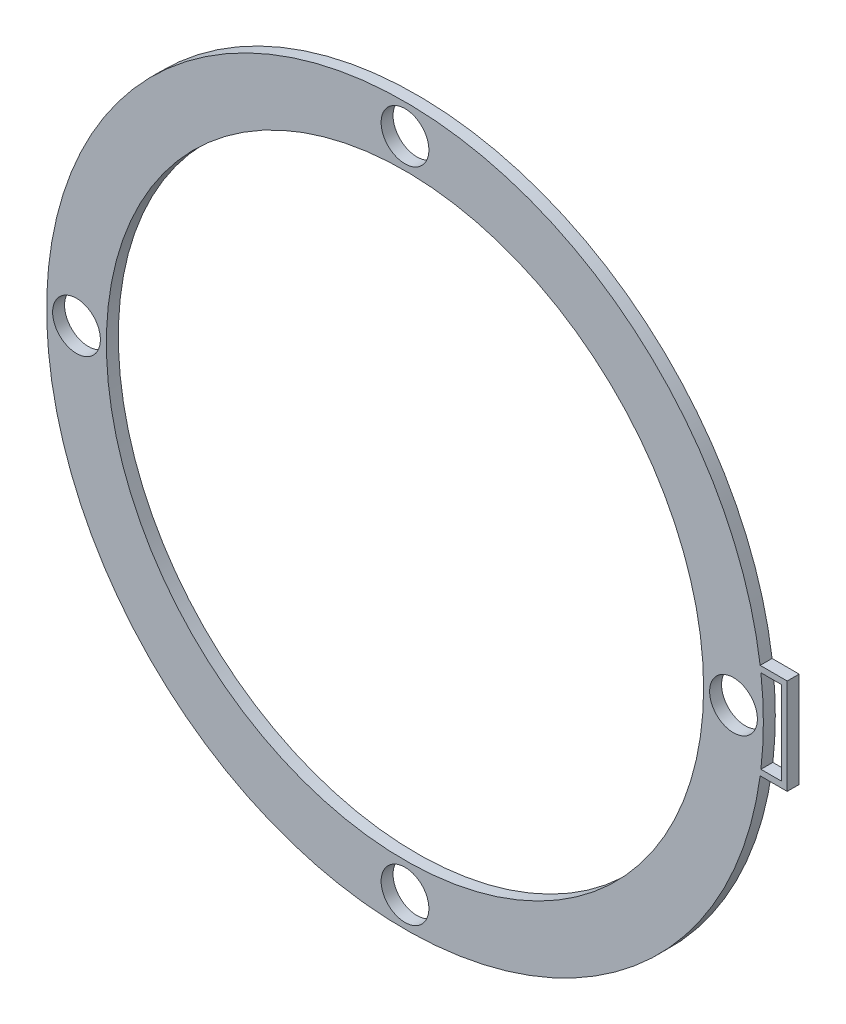
ISO-10303-21;
HEADER;
FILE_DESCRIPTION(('STEP AP214'),'2;1');
FILE_NAME('part.step','',(''),(''),'','','');
FILE_SCHEMA(('AUTOMOTIVE_DESIGN { 1 0 10303 214 1 1 1 1 }'));
ENDSEC;
DATA;
#1=APPLICATION_CONTEXT('core data for automotive mechanical design processes');
#2=APPLICATION_PROTOCOL_DEFINITION('international standard','automotive_design',2000,#1);
#3=PRODUCT_CONTEXT('',#1,'mechanical');
#4=PRODUCT('Part','Part','',(#3));
#5=PRODUCT_RELATED_PRODUCT_CATEGORY('part','',(#4));
#6=PRODUCT_DEFINITION_FORMATION('','',#4);
#7=PRODUCT_DEFINITION_CONTEXT('part definition',#1,'design');
#8=PRODUCT_DEFINITION('design','',#6,#7);
#9=PRODUCT_DEFINITION_SHAPE('','',#8);
#10=(LENGTH_UNIT() NAMED_UNIT(*) SI_UNIT(.MILLI.,.METRE.));
#11=(NAMED_UNIT(*) PLANE_ANGLE_UNIT() SI_UNIT($,.RADIAN.));
#12=(NAMED_UNIT(*) SI_UNIT($,.STERADIAN.) SOLID_ANGLE_UNIT());
#13=UNCERTAINTY_MEASURE_WITH_UNIT(LENGTH_MEASURE(1.E-05),#10,'distance_accuracy_value','');
#14=(GEOMETRIC_REPRESENTATION_CONTEXT(3) GLOBAL_UNCERTAINTY_ASSIGNED_CONTEXT((#13)) GLOBAL_UNIT_ASSIGNED_CONTEXT((#10,
#11,#12)) REPRESENTATION_CONTEXT('',''));
#15=CARTESIAN_POINT('',(0.,0.,0.));
#16=DIRECTION('',(0.,0.,1.));
#17=DIRECTION('',(1.,0.,0.));
#18=AXIS2_PLACEMENT_3D('',#15,#16,#17);
#19=CARTESIAN_POINT('',(0.219667479970261,0.,1.5));
#20=DIRECTION('',(0.,0.,-1.));
#21=DIRECTION('',(-1.,0.,0.));
#22=AXIS2_PLACEMENT_3D('',#19,#20,#21);
#23=CYLINDRICAL_SURFACE('',#22,30.);
#24=CARTESIAN_POINT('',(0.219667479970261,0.,0.5));
#25=DIRECTION('',(0.,0.,1.));
#26=DIRECTION('',(1.,0.,0.));
#27=AXIS2_PLACEMENT_3D('',#24,#25,#26);
#28=CIRCLE('',#27,30.);
#29=CARTESIAN_POINT('',(30.0148013108494,-3.5,0.5));
#30=VERTEX_POINT('',#29);
#31=CARTESIAN_POINT('',(30.0148013108494,3.5,0.5));
#32=VERTEX_POINT('',#31);
#33=EDGE_CURVE('E152',#30,#32,#28,.T.);
#34=ORIENTED_EDGE('',*,*,#33,.T.);
#35=DIRECTION('',(0.,0.,-1.));
#36=VECTOR('',#35,1.);
#37=CARTESIAN_POINT('',(30.0148013108494,3.5,1.5));
#38=LINE('',#37,#36);
#39=CARTESIAN_POINT('',(30.0148013108494,3.5,1.5));
#40=VERTEX_POINT('',#39);
#41=EDGE_CURVE('E11',#40,#32,#38,.T.);
#42=ORIENTED_EDGE('',*,*,#41,.F.);
#43=CARTESIAN_POINT('',(0.219667479970261,0.,1.5));
#44=DIRECTION('',(0.,0.,1.));
#45=DIRECTION('',(1.,0.,0.));
#46=AXIS2_PLACEMENT_3D('',#43,#44,#45);
#47=CIRCLE('',#46,30.);
#48=CARTESIAN_POINT('',(30.0148013108494,-3.5,1.5));
#49=VERTEX_POINT('',#48);
#50=EDGE_CURVE('E130',#49,#40,#47,.T.);
#51=ORIENTED_EDGE('',*,*,#50,.F.);
#52=DIRECTION('',(0.,0.,-1.));
#53=VECTOR('',#52,1.);
#54=CARTESIAN_POINT('',(30.0148013108494,-3.5,1.5));
#55=LINE('',#54,#53);
#56=EDGE_CURVE('E61',#49,#30,#55,.T.);
#57=ORIENTED_EDGE('',*,*,#56,.T.);
#58=EDGE_LOOP('',(#34,#42,#51,#57));
#59=FACE_BOUND('',#58,.T.);
#60=ADVANCED_FACE('F41',(#59),#23,.T.);
#61=CARTESIAN_POINT('',(0.219667479970261,3.5,1.5));
#62=DIRECTION('',(0.,-1.,0.));
#63=DIRECTION('',(0.,0.,-1.));
#64=AXIS2_PLACEMENT_3D('',#61,#62,#63);
#65=PLANE('',#64);
#66=DIRECTION('',(-1.,0.,0.));
#67=VECTOR('',#66,1.);
#68=CARTESIAN_POINT('',(0.219667479970261,3.5,0.5));
#69=LINE('',#68,#67);
#70=CARTESIAN_POINT('',(31.7196674799703,3.5,0.5));
#71=VERTEX_POINT('',#70);
#72=EDGE_CURVE('E119',#71,#32,#69,.T.);
#73=ORIENTED_EDGE('',*,*,#72,.F.);
#74=DIRECTION('',(0.,0.,-1.));
#75=VECTOR('',#74,1.);
#76=CARTESIAN_POINT('',(31.7196674799703,3.5,1.5));
#77=LINE('',#76,#75);
#78=CARTESIAN_POINT('',(31.7196674799703,3.5,1.5));
#79=VERTEX_POINT('',#78);
#80=EDGE_CURVE('E52',#79,#71,#77,.T.);
#81=ORIENTED_EDGE('',*,*,#80,.F.);
#82=DIRECTION('',(-1.,0.,0.));
#83=VECTOR('',#82,1.);
#84=CARTESIAN_POINT('',(0.219667479970261,3.5,1.5));
#85=LINE('',#84,#83);
#86=EDGE_CURVE('E117',#79,#40,#85,.T.);
#87=ORIENTED_EDGE('',*,*,#86,.T.);
#88=ORIENTED_EDGE('',*,*,#41,.T.);
#89=EDGE_LOOP('',(#73,#81,#87,#88));
#90=FACE_BOUND('',#89,.T.);
#91=ADVANCED_FACE('F116',(#90),#65,.T.);
#92=CARTESIAN_POINT('',(31.7196674799703,0.,1.5));
#93=DIRECTION('',(-1.,0.,0.));
#94=DIRECTION('',(0.,0.,1.));
#95=AXIS2_PLACEMENT_3D('',#92,#93,#94);
#96=PLANE('',#95);
#97=DIRECTION('',(0.,1.,0.));
#98=VECTOR('',#97,1.);
#99=CARTESIAN_POINT('',(31.7196674799703,0.,0.5));
#100=LINE('',#99,#98);
#101=CARTESIAN_POINT('',(31.7196674799703,-3.5,0.5));
#102=VERTEX_POINT('',#101);
#103=EDGE_CURVE('E182',#102,#71,#100,.T.);
#104=ORIENTED_EDGE('',*,*,#103,.F.);
#105=DIRECTION('',(0.,0.,-1.));
#106=VECTOR('',#105,1.);
#107=CARTESIAN_POINT('',(31.7196674799703,-3.5,1.5));
#108=LINE('',#107,#106);
#109=CARTESIAN_POINT('',(31.7196674799703,-3.5,1.5));
#110=VERTEX_POINT('',#109);
#111=EDGE_CURVE('E86',#110,#102,#108,.T.);
#112=ORIENTED_EDGE('',*,*,#111,.F.);
#113=DIRECTION('',(0.,1.,0.));
#114=VECTOR('',#113,1.);
#115=CARTESIAN_POINT('',(31.7196674799703,0.,1.5));
#116=LINE('',#115,#114);
#117=EDGE_CURVE('E129',#110,#79,#116,.T.);
#118=ORIENTED_EDGE('',*,*,#117,.T.);
#119=ORIENTED_EDGE('',*,*,#80,.T.);
#120=EDGE_LOOP('',(#104,#112,#118,#119));
#121=FACE_BOUND('',#120,.T.);
#122=ADVANCED_FACE('F134',(#121),#96,.T.);
#123=CARTESIAN_POINT('',(0.219667479970261,4.00307461932263,1.5));
#124=DIRECTION('',(0.,-1.,0.));
#125=DIRECTION('',(0.,0.,-1.));
#126=AXIS2_PLACEMENT_3D('',#123,#124,#125);
#127=PLANE('',#126);
#128=DIRECTION('',(-1.,0.,0.));
#129=VECTOR('',#128,1.);
#130=CARTESIAN_POINT('',(0.219667479970261,4.00307461932263,0.5));
#131=LINE('',#130,#129);
#132=CARTESIAN_POINT('',(32.2173219740412,4.00307461932263,0.5));
#133=VERTEX_POINT('',#132);
#134=CARTESIAN_POINT('',(29.9513911701994,4.00307461932263,0.5));
#135=VERTEX_POINT('',#134);
#136=EDGE_CURVE('E143',#133,#135,#131,.T.);
#137=ORIENTED_EDGE('',*,*,#136,.T.);
#138=DIRECTION('',(0.,0.,-1.));
#139=VECTOR('',#138,1.);
#140=CARTESIAN_POINT('',(29.9513911701994,4.00307461932263,1.5));
#141=LINE('',#140,#139);
#142=CARTESIAN_POINT('',(29.9513911701994,4.00307461932263,1.5));
#143=VERTEX_POINT('',#142);
#144=EDGE_CURVE('E45',#143,#135,#141,.T.);
#145=ORIENTED_EDGE('',*,*,#144,.F.);
#146=DIRECTION('',(-1.,0.,0.));
#147=VECTOR('',#146,1.);
#148=CARTESIAN_POINT('',(0.219667479970261,4.00307461932263,1.5));
#149=LINE('',#148,#147);
#150=CARTESIAN_POINT('',(32.2173219740412,4.00307461932263,1.5));
#151=VERTEX_POINT('',#150);
#152=EDGE_CURVE('E189',#151,#143,#149,.T.);
#153=ORIENTED_EDGE('',*,*,#152,.F.);
#154=DIRECTION('',(0.,0.,-1.));
#155=VECTOR('',#154,1.);
#156=CARTESIAN_POINT('',(32.2173219740412,4.00307461932263,1.5));
#157=LINE('',#156,#155);
#158=EDGE_CURVE('E139',#151,#133,#157,.T.);
#159=ORIENTED_EDGE('',*,*,#158,.T.);
#160=EDGE_LOOP('',(#137,#145,#153,#159));
#161=FACE_BOUND('',#160,.T.);
#162=ADVANCED_FACE('F43',(#161),#127,.F.);
#163=CARTESIAN_POINT('',(29.9513911701994,-4.00307461932264,0.5));
#164=VERTEX_POINT('',#163);
#165=EDGE_CURVE('E147',#135,#164,#28,.T.);
#166=ORIENTED_EDGE('',*,*,#165,.T.);
#167=DIRECTION('',(0.,0.,-1.));
#168=VECTOR('',#167,1.);
#169=CARTESIAN_POINT('',(29.9513911701994,-4.00307461932264,1.5));
#170=LINE('',#169,#168);
#171=CARTESIAN_POINT('',(29.9513911701994,-4.00307461932264,1.5));
#172=VERTEX_POINT('',#171);
#173=EDGE_CURVE('E198',#172,#164,#170,.T.);
#174=ORIENTED_EDGE('',*,*,#173,.F.);
#175=EDGE_CURVE('E99',#143,#172,#47,.T.);
#176=ORIENTED_EDGE('',*,*,#175,.F.);
#177=ORIENTED_EDGE('',*,*,#144,.T.);
#178=EDGE_LOOP('',(#166,#174,#176,#177));
#179=FACE_BOUND('',#178,.T.);
#180=ADVANCED_FACE('F205',(#179),#23,.T.);
#181=CARTESIAN_POINT('',(0.219667479970261,-4.00307461932264,1.5));
#182=DIRECTION('',(0.,-1.,0.));
#183=DIRECTION('',(0.,0.,-1.));
#184=AXIS2_PLACEMENT_3D('',#181,#182,#183);
#185=PLANE('',#184);
#186=DIRECTION('',(-1.,0.,0.));
#187=VECTOR('',#186,1.);
#188=CARTESIAN_POINT('',(0.219667479970261,-4.00307461932264,0.5));
#189=LINE('',#188,#187);
#190=CARTESIAN_POINT('',(32.2173219740412,-4.00307461932264,0.5));
#191=VERTEX_POINT('',#190);
#192=EDGE_CURVE('E151',#191,#164,#189,.T.);
#193=ORIENTED_EDGE('',*,*,#192,.F.);
#194=DIRECTION('',(0.,0.,-1.));
#195=VECTOR('',#194,1.);
#196=CARTESIAN_POINT('',(32.2173219740412,-4.00307461932264,1.5));
#197=LINE('',#196,#195);
#198=CARTESIAN_POINT('',(32.2173219740412,-4.00307461932264,1.5));
#199=VERTEX_POINT('',#198);
#200=EDGE_CURVE('E196',#199,#191,#197,.T.);
#201=ORIENTED_EDGE('',*,*,#200,.F.);
#202=DIRECTION('',(-1.,0.,0.));
#203=VECTOR('',#202,1.);
#204=CARTESIAN_POINT('',(0.219667479970261,-4.00307461932264,1.5));
#205=LINE('',#204,#203);
#206=EDGE_CURVE('E367',#199,#172,#205,.T.);
#207=ORIENTED_EDGE('',*,*,#206,.T.);
#208=ORIENTED_EDGE('',*,*,#173,.T.);
#209=EDGE_LOOP('',(#193,#201,#207,#208));
#210=FACE_BOUND('',#209,.T.);
#211=ADVANCED_FACE('F219',(#210),#185,.T.);
#212=CARTESIAN_POINT('',(0.219667479970261,0.,1.5));
#213=DIRECTION('',(0.,0.,-1.));
#214=DIRECTION('',(-1.,0.,0.));
#215=AXIS2_PLACEMENT_3D('',#212,#213,#214);
#216=CYLINDRICAL_SURFACE('',#215,25.);
#217=CARTESIAN_POINT('',(0.219667479970261,0.,1.5));
#218=DIRECTION('',(0.,0.,1.));
#219=DIRECTION('',(1.,0.,0.));
#220=AXIS2_PLACEMENT_3D('',#217,#218,#219);
#221=CIRCLE('',#220,25.);
#222=CARTESIAN_POINT('',(25.2196674799703,0.,1.5));
#223=VERTEX_POINT('',#222);
#224=EDGE_CURVE('E388',#223,#223,#221,.T.);
#225=ORIENTED_EDGE('',*,*,#224,.T.);
#226=EDGE_LOOP('',(#225));
#227=FACE_BOUND('',#226,.T.);
#228=CARTESIAN_POINT('',(0.219667479970261,0.,0.5));
#229=DIRECTION('',(0.,0.,1.));
#230=DIRECTION('',(1.,0.,0.));
#231=AXIS2_PLACEMENT_3D('',#228,#229,#230);
#232=CIRCLE('',#231,25.);
#233=CARTESIAN_POINT('',(25.2196674799703,0.,0.5));
#234=VERTEX_POINT('',#233);
#235=EDGE_CURVE('E176',#234,#234,#232,.T.);
#236=ORIENTED_EDGE('',*,*,#235,.F.);
#237=EDGE_LOOP('',(#236));
#238=FACE_BOUND('',#237,.T.);
#239=ADVANCED_FACE('F221',(#227,#238),#216,.F.);
#240=CARTESIAN_POINT('',(27.7196674799703,0.,1.5));
#241=DIRECTION('',(0.,0.,-1.));
#242=DIRECTION('',(-1.,0.,0.));
#243=AXIS2_PLACEMENT_3D('',#240,#241,#242);
#244=CYLINDRICAL_SURFACE('',#243,2.);
#245=CARTESIAN_POINT('',(27.7196674799703,0.,1.5));
#246=DIRECTION('',(0.,0.,1.));
#247=DIRECTION('',(1.,0.,0.));
#248=AXIS2_PLACEMENT_3D('',#245,#246,#247);
#249=CIRCLE('',#248,2.);
#250=CARTESIAN_POINT('',(29.7196674799703,0.,1.5));
#251=VERTEX_POINT('',#250);
#252=EDGE_CURVE('E384',#251,#251,#249,.T.);
#253=ORIENTED_EDGE('',*,*,#252,.T.);
#254=EDGE_LOOP('',(#253));
#255=FACE_BOUND('',#254,.T.);
#256=CARTESIAN_POINT('',(27.7196674799703,0.,0.5));
#257=DIRECTION('',(0.,0.,1.));
#258=DIRECTION('',(1.,0.,0.));
#259=AXIS2_PLACEMENT_3D('',#256,#257,#258);
#260=CIRCLE('',#259,2.);
#261=CARTESIAN_POINT('',(29.7196674799703,0.,0.5));
#262=VERTEX_POINT('',#261);
#263=EDGE_CURVE('E172',#262,#262,#260,.T.);
#264=ORIENTED_EDGE('',*,*,#263,.F.);
#265=EDGE_LOOP('',(#264));
#266=FACE_BOUND('',#265,.T.);
#267=ADVANCED_FACE('F226',(#255,#266),#244,.F.);
#268=CARTESIAN_POINT('',(0.219667479970165,-27.5,1.5));
#269=DIRECTION('',(0.,0.,-1.));
#270=DIRECTION('',(-1.,0.,0.));
#271=AXIS2_PLACEMENT_3D('',#268,#269,#270);
#272=CYLINDRICAL_SURFACE('',#271,2.);
#273=CARTESIAN_POINT('',(0.219667479970165,-27.5,1.5));
#274=DIRECTION('',(0.,0.,1.));
#275=DIRECTION('',(1.,0.,0.));
#276=AXIS2_PLACEMENT_3D('',#273,#274,#275);
#277=CIRCLE('',#276,2.);
#278=CARTESIAN_POINT('',(2.21966747997017,-27.5,1.5));
#279=VERTEX_POINT('',#278);
#280=EDGE_CURVE('E380',#279,#279,#277,.T.);
#281=ORIENTED_EDGE('',*,*,#280,.T.);
#282=EDGE_LOOP('',(#281));
#283=FACE_BOUND('',#282,.T.);
#284=CARTESIAN_POINT('',(0.219667479970165,-27.5,0.5));
#285=DIRECTION('',(0.,0.,1.));
#286=DIRECTION('',(1.,0.,0.));
#287=AXIS2_PLACEMENT_3D('',#284,#285,#286);
#288=CIRCLE('',#287,2.);
#289=CARTESIAN_POINT('',(2.21966747997017,-27.5,0.5));
#290=VERTEX_POINT('',#289);
#291=EDGE_CURVE('E168',#290,#290,#288,.T.);
#292=ORIENTED_EDGE('',*,*,#291,.F.);
#293=EDGE_LOOP('',(#292));
#294=FACE_BOUND('',#293,.T.);
#295=ADVANCED_FACE('F240',(#283,#294),#272,.F.);
#296=CARTESIAN_POINT('',(-27.2803325200297,1.90260920341529E-13,1.5));
#297=DIRECTION('',(0.,0.,-1.));
#298=DIRECTION('',(-1.,0.,0.));
#299=AXIS2_PLACEMENT_3D('',#296,#297,#298);
#300=CYLINDRICAL_SURFACE('',#299,2.);
#301=CARTESIAN_POINT('',(-27.2803325200297,1.90260920341529E-13,1.5));
#302=DIRECTION('',(0.,0.,1.));
#303=DIRECTION('',(1.,0.,0.));
#304=AXIS2_PLACEMENT_3D('',#301,#302,#303);
#305=CIRCLE('',#304,2.);
#306=CARTESIAN_POINT('',(-25.2803325200297,1.90260920341529E-13,1.5));
#307=VERTEX_POINT('',#306);
#308=EDGE_CURVE('E376',#307,#307,#305,.T.);
#309=ORIENTED_EDGE('',*,*,#308,.T.);
#310=EDGE_LOOP('',(#309));
#311=FACE_BOUND('',#310,.T.);
#312=CARTESIAN_POINT('',(-27.2803325200297,1.90260920341529E-13,0.5));
#313=DIRECTION('',(0.,0.,1.));
#314=DIRECTION('',(1.,0.,0.));
#315=AXIS2_PLACEMENT_3D('',#312,#313,#314);
#316=CIRCLE('',#315,2.);
#317=CARTESIAN_POINT('',(-25.2803325200297,1.90260920341529E-13,0.5));
#318=VERTEX_POINT('',#317);
#319=EDGE_CURVE('E164',#318,#318,#316,.T.);
#320=ORIENTED_EDGE('',*,*,#319,.F.);
#321=EDGE_LOOP('',(#320));
#322=FACE_BOUND('',#321,.T.);
#323=ADVANCED_FACE('F244',(#311,#322),#300,.F.);
#324=CARTESIAN_POINT('',(0.219667479970549,27.5,1.5));
#325=DIRECTION('',(0.,0.,-1.));
#326=DIRECTION('',(-1.,0.,0.));
#327=AXIS2_PLACEMENT_3D('',#324,#325,#326);
#328=CYLINDRICAL_SURFACE('',#327,2.);
#329=CARTESIAN_POINT('',(0.219667479970549,27.5,1.5));
#330=DIRECTION('',(0.,0.,1.));
#331=DIRECTION('',(1.,0.,0.));
#332=AXIS2_PLACEMENT_3D('',#329,#330,#331);
#333=CIRCLE('',#332,2.);
#334=CARTESIAN_POINT('',(2.21966747997055,27.5,1.5));
#335=VERTEX_POINT('',#334);
#336=EDGE_CURVE('E372',#335,#335,#333,.T.);
#337=ORIENTED_EDGE('',*,*,#336,.T.);
#338=EDGE_LOOP('',(#337));
#339=FACE_BOUND('',#338,.T.);
#340=CARTESIAN_POINT('',(0.219667479970549,27.5,0.5));
#341=DIRECTION('',(0.,0.,1.));
#342=DIRECTION('',(1.,0.,0.));
#343=AXIS2_PLACEMENT_3D('',#340,#341,#342);
#344=CIRCLE('',#343,2.);
#345=CARTESIAN_POINT('',(2.21966747997055,27.5,0.5));
#346=VERTEX_POINT('',#345);
#347=EDGE_CURVE('E160',#346,#346,#344,.T.);
#348=ORIENTED_EDGE('',*,*,#347,.F.);
#349=EDGE_LOOP('',(#348));
#350=FACE_BOUND('',#349,.T.);
#351=ADVANCED_FACE('F248',(#339,#350),#328,.F.);
#352=CARTESIAN_POINT('',(32.2173219740412,0.,1.5));
#353=DIRECTION('',(1.,0.,0.));
#354=DIRECTION('',(0.,0.,-1.));
#355=AXIS2_PLACEMENT_3D('',#352,#353,#354);
#356=PLANE('',#355);
#357=DIRECTION('',(0.,-1.,0.));
#358=VECTOR('',#357,1.);
#359=CARTESIAN_POINT('',(32.2173219740412,0.,0.5));
#360=LINE('',#359,#358);
#361=EDGE_CURVE('E156',#133,#191,#360,.T.);
#362=ORIENTED_EDGE('',*,*,#361,.F.);
#363=ORIENTED_EDGE('',*,*,#158,.F.);
#364=DIRECTION('',(0.,-1.,0.));
#365=VECTOR('',#364,1.);
#366=CARTESIAN_POINT('',(32.2173219740412,0.,1.5));
#367=LINE('',#366,#365);
#368=EDGE_CURVE('E217',#151,#199,#367,.T.);
#369=ORIENTED_EDGE('',*,*,#368,.T.);
#370=ORIENTED_EDGE('',*,*,#200,.T.);
#371=EDGE_LOOP('',(#362,#363,#369,#370));
#372=FACE_BOUND('',#371,.T.);
#373=ADVANCED_FACE('F214',(#372),#356,.T.);
#374=CARTESIAN_POINT('',(0.219667479970261,-3.5,1.5));
#375=DIRECTION('',(0.,1.,0.));
#376=DIRECTION('',(0.,0.,1.));
#377=AXIS2_PLACEMENT_3D('',#374,#375,#376);
#378=PLANE('',#377);
#379=DIRECTION('',(1.,0.,0.));
#380=VECTOR('',#379,1.);
#381=CARTESIAN_POINT('',(0.219667479970261,-3.5,0.5));
#382=LINE('',#381,#380);
#383=EDGE_CURVE('E185',#30,#102,#382,.T.);
#384=ORIENTED_EDGE('',*,*,#383,.F.);
#385=ORIENTED_EDGE('',*,*,#56,.F.);
#386=DIRECTION('',(1.,0.,0.));
#387=VECTOR('',#386,1.);
#388=CARTESIAN_POINT('',(0.219667479970261,-3.5,1.5));
#389=LINE('',#388,#387);
#390=EDGE_CURVE('E136',#49,#110,#389,.T.);
#391=ORIENTED_EDGE('',*,*,#390,.T.);
#392=ORIENTED_EDGE('',*,*,#111,.T.);
#393=EDGE_LOOP('',(#384,#385,#391,#392));
#394=FACE_BOUND('',#393,.T.);
#395=ADVANCED_FACE('F253',(#394),#378,.T.);
#396=CARTESIAN_POINT('',(0.219667479970261,0.,1.5));
#397=DIRECTION('',(0.,0.,1.));
#398=DIRECTION('',(1.,0.,0.));
#399=AXIS2_PLACEMENT_3D('',#396,#397,#398);
#400=PLANE('',#399);
#401=ORIENTED_EDGE('',*,*,#152,.T.);
#402=ORIENTED_EDGE('',*,*,#175,.T.);
#403=ORIENTED_EDGE('',*,*,#206,.F.);
#404=ORIENTED_EDGE('',*,*,#368,.F.);
#405=EDGE_LOOP('',(#401,#402,#403,#404));
#406=FACE_BOUND('',#405,.T.);
#407=ORIENTED_EDGE('',*,*,#336,.F.);
#408=EDGE_LOOP('',(#407));
#409=FACE_BOUND('',#408,.T.);
#410=ORIENTED_EDGE('',*,*,#308,.F.);
#411=EDGE_LOOP('',(#410));
#412=FACE_BOUND('',#411,.T.);
#413=ORIENTED_EDGE('',*,*,#280,.F.);
#414=EDGE_LOOP('',(#413));
#415=FACE_BOUND('',#414,.T.);
#416=ORIENTED_EDGE('',*,*,#252,.F.);
#417=EDGE_LOOP('',(#416));
#418=FACE_BOUND('',#417,.T.);
#419=ORIENTED_EDGE('',*,*,#224,.F.);
#420=EDGE_LOOP('',(#419));
#421=FACE_BOUND('',#420,.T.);
#422=ORIENTED_EDGE('',*,*,#50,.T.);
#423=ORIENTED_EDGE('',*,*,#86,.F.);
#424=ORIENTED_EDGE('',*,*,#117,.F.);
#425=ORIENTED_EDGE('',*,*,#390,.F.);
#426=EDGE_LOOP('',(#422,#423,#424,#425));
#427=FACE_BOUND('',#426,.T.);
#428=ADVANCED_FACE('F127',(#406,#409,#412,#415,#418,#421,#427),#400,.T.);
#429=CARTESIAN_POINT('',(0.219667479970261,0.,0.5));
#430=DIRECTION('',(0.,0.,1.));
#431=DIRECTION('',(1.,0.,0.));
#432=AXIS2_PLACEMENT_3D('',#429,#430,#431);
#433=PLANE('',#432);
#434=ORIENTED_EDGE('',*,*,#136,.F.);
#435=ORIENTED_EDGE('',*,*,#361,.T.);
#436=ORIENTED_EDGE('',*,*,#192,.T.);
#437=ORIENTED_EDGE('',*,*,#165,.F.);
#438=EDGE_LOOP('',(#434,#435,#436,#437));
#439=FACE_BOUND('',#438,.T.);
#440=ORIENTED_EDGE('',*,*,#347,.T.);
#441=EDGE_LOOP('',(#440));
#442=FACE_BOUND('',#441,.T.);
#443=ORIENTED_EDGE('',*,*,#319,.T.);
#444=EDGE_LOOP('',(#443));
#445=FACE_BOUND('',#444,.T.);
#446=ORIENTED_EDGE('',*,*,#291,.T.);
#447=EDGE_LOOP('',(#446));
#448=FACE_BOUND('',#447,.T.);
#449=ORIENTED_EDGE('',*,*,#263,.T.);
#450=EDGE_LOOP('',(#449));
#451=FACE_BOUND('',#450,.T.);
#452=ORIENTED_EDGE('',*,*,#235,.T.);
#453=EDGE_LOOP('',(#452));
#454=FACE_BOUND('',#453,.T.);
#455=ORIENTED_EDGE('',*,*,#33,.F.);
#456=ORIENTED_EDGE('',*,*,#383,.T.);
#457=ORIENTED_EDGE('',*,*,#103,.T.);
#458=ORIENTED_EDGE('',*,*,#72,.T.);
#459=EDGE_LOOP('',(#455,#456,#457,#458));
#460=FACE_BOUND('',#459,.T.);
#461=ADVANCED_FACE('F211',(#439,#442,#445,#448,#451,#454,#460),#433,.F.);
#462=CLOSED_SHELL('',(#60,#91,#122,#162,#180,#211,#239,#267,#295,#323,#351,#373,#395,#428,#461));
#463=MANIFOLD_SOLID_BREP('B2',#462);
#464=ADVANCED_BREP_SHAPE_REPRESENTATION('',(#18,#463),#14);
#465=SHAPE_DEFINITION_REPRESENTATION(#9,#464);
ENDSEC;
END-ISO-10303-21;
